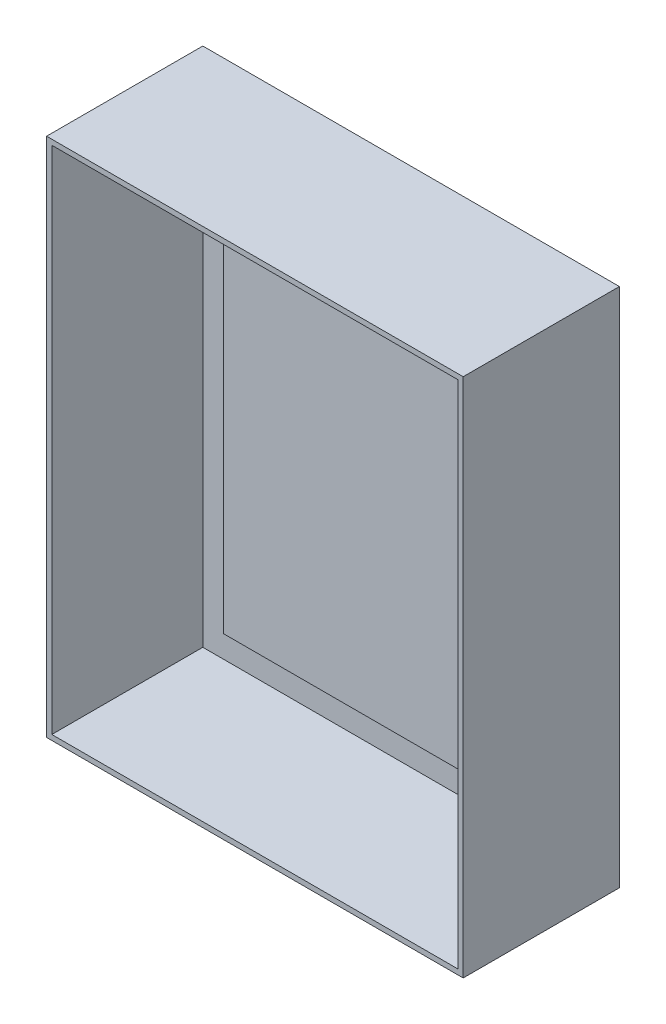
ISO-10303-21;
HEADER;
FILE_DESCRIPTION(('STEP AP214'),'2;1');
FILE_NAME('part.step','',(''),(''),'','','');
FILE_SCHEMA(('AUTOMOTIVE_DESIGN { 1 0 10303 214 1 1 1 1 }'));
ENDSEC;
DATA;
#1=APPLICATION_CONTEXT('core data for automotive mechanical design processes');
#2=APPLICATION_PROTOCOL_DEFINITION('international standard','automotive_design',2000,#1);
#3=PRODUCT_CONTEXT('',#1,'mechanical');
#4=PRODUCT('Part','Part','',(#3));
#5=PRODUCT_RELATED_PRODUCT_CATEGORY('part','',(#4));
#6=PRODUCT_DEFINITION_FORMATION('','',#4);
#7=PRODUCT_DEFINITION_CONTEXT('part definition',#1,'design');
#8=PRODUCT_DEFINITION('design','',#6,#7);
#9=PRODUCT_DEFINITION_SHAPE('','',#8);
#10=(LENGTH_UNIT() NAMED_UNIT(*) SI_UNIT(.MILLI.,.METRE.));
#11=(NAMED_UNIT(*) PLANE_ANGLE_UNIT() SI_UNIT($,.RADIAN.));
#12=(NAMED_UNIT(*) SI_UNIT($,.STERADIAN.) SOLID_ANGLE_UNIT());
#13=UNCERTAINTY_MEASURE_WITH_UNIT(LENGTH_MEASURE(1.E-05),#10,'distance_accuracy_value','');
#14=(GEOMETRIC_REPRESENTATION_CONTEXT(3) GLOBAL_UNCERTAINTY_ASSIGNED_CONTEXT((#13)) GLOBAL_UNIT_ASSIGNED_CONTEXT((#10,
#11,#12)) REPRESENTATION_CONTEXT('',''));
#15=CARTESIAN_POINT('',(0.,0.,0.));
#16=DIRECTION('',(0.,0.,1.));
#17=DIRECTION('',(1.,0.,0.));
#18=AXIS2_PLACEMENT_3D('',#15,#16,#17);
#19=CARTESIAN_POINT('',(0.,0.,5.08));
#20=DIRECTION('',(0.,0.,1.));
#21=DIRECTION('',(1.,0.,0.));
#22=AXIS2_PLACEMENT_3D('',#19,#20,#21);
#23=PLANE('',#22);
#24=DIRECTION('',(0.,1.,0.));
#25=VECTOR('',#24,1.);
#26=CARTESIAN_POINT('',(198.12,254.,5.08));
#27=LINE('',#26,#25);
#28=CARTESIAN_POINT('',(198.12,-248.92,5.08));
#29=VERTEX_POINT('',#28);
#30=CARTESIAN_POINT('',(198.12,248.92,5.08));
#31=VERTEX_POINT('',#30);
#32=EDGE_CURVE('E164',#29,#31,#27,.T.);
#33=ORIENTED_EDGE('',*,*,#32,.T.);
#34=DIRECTION('',(-1.,0.,0.));
#35=VECTOR('',#34,1.);
#36=CARTESIAN_POINT('',(-203.2,248.92,5.08));
#37=LINE('',#36,#35);
#38=CARTESIAN_POINT('',(-198.12,248.92,5.08));
#39=VERTEX_POINT('',#38);
#40=EDGE_CURVE('E167',#31,#39,#37,.T.);
#41=ORIENTED_EDGE('',*,*,#40,.T.);
#42=DIRECTION('',(0.,-1.,0.));
#43=VECTOR('',#42,1.);
#44=CARTESIAN_POINT('',(-198.12,254.,5.08));
#45=LINE('',#44,#43);
#46=CARTESIAN_POINT('',(-198.12,-248.92,5.08));
#47=VERTEX_POINT('',#46);
#48=EDGE_CURVE('E182',#39,#47,#45,.T.);
#49=ORIENTED_EDGE('',*,*,#48,.T.);
#50=DIRECTION('',(1.,0.,0.));
#51=VECTOR('',#50,1.);
#52=CARTESIAN_POINT('',(-203.2,-248.92,5.08));
#53=LINE('',#52,#51);
#54=EDGE_CURVE('E186',#47,#29,#53,.T.);
#55=ORIENTED_EDGE('',*,*,#54,.T.);
#56=EDGE_LOOP('',(#33,#41,#49,#55));
#57=FACE_BOUND('',#56,.T.);
#58=DIRECTION('',(-1.,0.,0.));
#59=VECTOR('',#58,1.);
#60=CARTESIAN_POINT('',(-175.26,224.79,5.08));
#61=LINE('',#60,#59);
#62=CARTESIAN_POINT('',(175.26,224.79,5.08));
#63=VERTEX_POINT('',#62);
#64=CARTESIAN_POINT('',(-175.26,224.79,5.08));
#65=VERTEX_POINT('',#64);
#66=EDGE_CURVE('E365',#63,#65,#61,.T.);
#67=ORIENTED_EDGE('',*,*,#66,.F.);
#68=DIRECTION('',(0.,1.,0.));
#69=VECTOR('',#68,1.);
#70=CARTESIAN_POINT('',(175.26,224.79,5.08));
#71=LINE('',#70,#69);
#72=CARTESIAN_POINT('',(175.26,-224.79,5.08));
#73=VERTEX_POINT('',#72);
#74=EDGE_CURVE('E162',#73,#63,#71,.T.);
#75=ORIENTED_EDGE('',*,*,#74,.F.);
#76=DIRECTION('',(1.,0.,0.));
#77=VECTOR('',#76,1.);
#78=CARTESIAN_POINT('',(-175.26,-224.79,5.08));
#79=LINE('',#78,#77);
#80=CARTESIAN_POINT('',(-175.26,-224.79,5.08));
#81=VERTEX_POINT('',#80);
#82=EDGE_CURVE('E158',#81,#73,#79,.T.);
#83=ORIENTED_EDGE('',*,*,#82,.F.);
#84=DIRECTION('',(0.,-1.,0.));
#85=VECTOR('',#84,1.);
#86=CARTESIAN_POINT('',(-175.26,224.79,5.08));
#87=LINE('',#86,#85);
#88=EDGE_CURVE('E362',#65,#81,#87,.T.);
#89=ORIENTED_EDGE('',*,*,#88,.F.);
#90=EDGE_LOOP('',(#67,#75,#83,#89));
#91=FACE_BOUND('',#90,.T.);
#92=ADVANCED_FACE('F49',(#57,#91),#23,.T.);
#93=CARTESIAN_POINT('',(203.2,254.,152.4));
#94=DIRECTION('',(-1.,0.,0.));
#95=DIRECTION('',(0.,-1.,0.));
#96=AXIS2_PLACEMENT_3D('',#93,#94,#95);
#97=PLANE('',#96);
#98=DIRECTION('',(0.,1.,0.));
#99=VECTOR('',#98,1.);
#100=CARTESIAN_POINT('',(203.2,254.,0.));
#101=LINE('',#100,#99);
#102=CARTESIAN_POINT('',(203.2,-254.,0.));
#103=VERTEX_POINT('',#102);
#104=CARTESIAN_POINT('',(203.2,254.,0.));
#105=VERTEX_POINT('',#104);
#106=EDGE_CURVE('E175',#103,#105,#101,.T.);
#107=ORIENTED_EDGE('',*,*,#106,.T.);
#108=DIRECTION('',(0.,0.,-1.));
#109=VECTOR('',#108,1.);
#110=CARTESIAN_POINT('',(203.2,254.,152.4));
#111=LINE('',#110,#109);
#112=CARTESIAN_POINT('',(203.2,254.,152.4));
#113=VERTEX_POINT('',#112);
#114=EDGE_CURVE('E11',#113,#105,#111,.T.);
#115=ORIENTED_EDGE('',*,*,#114,.F.);
#116=DIRECTION('',(0.,1.,0.));
#117=VECTOR('',#116,1.);
#118=CARTESIAN_POINT('',(203.2,254.,152.4));
#119=LINE('',#118,#117);
#120=CARTESIAN_POINT('',(203.2,-254.,152.4));
#121=VERTEX_POINT('',#120);
#122=EDGE_CURVE('E196',#121,#113,#119,.T.);
#123=ORIENTED_EDGE('',*,*,#122,.F.);
#124=DIRECTION('',(0.,0.,-1.));
#125=VECTOR('',#124,1.);
#126=CARTESIAN_POINT('',(203.2,-254.,152.4));
#127=LINE('',#126,#125);
#128=EDGE_CURVE('E206',#121,#103,#127,.T.);
#129=ORIENTED_EDGE('',*,*,#128,.T.);
#130=EDGE_LOOP('',(#107,#115,#123,#129));
#131=FACE_BOUND('',#130,.T.);
#132=ADVANCED_FACE('F51',(#131),#97,.F.);
#133=CARTESIAN_POINT('',(-203.2,254.,152.4));
#134=DIRECTION('',(0.,-1.,0.));
#135=DIRECTION('',(0.,0.,-1.));
#136=AXIS2_PLACEMENT_3D('',#133,#134,#135);
#137=PLANE('',#136);
#138=DIRECTION('',(-1.,0.,0.));
#139=VECTOR('',#138,1.);
#140=CARTESIAN_POINT('',(-203.2,254.,0.));
#141=LINE('',#140,#139);
#142=CARTESIAN_POINT('',(-203.2,254.,0.));
#143=VERTEX_POINT('',#142);
#144=EDGE_CURVE('E209',#105,#143,#141,.T.);
#145=ORIENTED_EDGE('',*,*,#144,.T.);
#146=DIRECTION('',(0.,0.,-1.));
#147=VECTOR('',#146,1.);
#148=CARTESIAN_POINT('',(-203.2,254.,152.4));
#149=LINE('',#148,#147);
#150=CARTESIAN_POINT('',(-203.2,254.,152.4));
#151=VERTEX_POINT('',#150);
#152=EDGE_CURVE('E57',#151,#143,#149,.T.);
#153=ORIENTED_EDGE('',*,*,#152,.F.);
#154=DIRECTION('',(-1.,0.,0.));
#155=VECTOR('',#154,1.);
#156=CARTESIAN_POINT('',(-203.2,254.,152.4));
#157=LINE('',#156,#155);
#158=EDGE_CURVE('E199',#113,#151,#157,.T.);
#159=ORIENTED_EDGE('',*,*,#158,.F.);
#160=ORIENTED_EDGE('',*,*,#114,.T.);
#161=EDGE_LOOP('',(#145,#153,#159,#160));
#162=FACE_BOUND('',#161,.T.);
#163=ADVANCED_FACE('F239',(#162),#137,.F.);
#164=CARTESIAN_POINT('',(-203.2,254.,152.4));
#165=DIRECTION('',(1.,0.,0.));
#166=DIRECTION('',(0.,1.,0.));
#167=AXIS2_PLACEMENT_3D('',#164,#165,#166);
#168=PLANE('',#167);
#169=DIRECTION('',(0.,-1.,0.));
#170=VECTOR('',#169,1.);
#171=CARTESIAN_POINT('',(-203.2,254.,0.));
#172=LINE('',#171,#170);
#173=CARTESIAN_POINT('',(-203.2,-254.,0.));
#174=VERTEX_POINT('',#173);
#175=EDGE_CURVE('E211',#143,#174,#172,.T.);
#176=ORIENTED_EDGE('',*,*,#175,.T.);
#177=DIRECTION('',(0.,0.,-1.));
#178=VECTOR('',#177,1.);
#179=CARTESIAN_POINT('',(-203.2,-254.,152.4));
#180=LINE('',#179,#178);
#181=CARTESIAN_POINT('',(-203.2,-254.,152.4));
#182=VERTEX_POINT('',#181);
#183=EDGE_CURVE('E216',#182,#174,#180,.T.);
#184=ORIENTED_EDGE('',*,*,#183,.F.);
#185=DIRECTION('',(0.,-1.,0.));
#186=VECTOR('',#185,1.);
#187=CARTESIAN_POINT('',(-203.2,254.,152.4));
#188=LINE('',#187,#186);
#189=EDGE_CURVE('E202',#151,#182,#188,.T.);
#190=ORIENTED_EDGE('',*,*,#189,.F.);
#191=ORIENTED_EDGE('',*,*,#152,.T.);
#192=EDGE_LOOP('',(#176,#184,#190,#191));
#193=FACE_BOUND('',#192,.T.);
#194=ADVANCED_FACE('F223',(#193),#168,.F.);
#195=CARTESIAN_POINT('',(-203.2,-254.,152.4));
#196=DIRECTION('',(0.,1.,0.));
#197=DIRECTION('',(0.,0.,1.));
#198=AXIS2_PLACEMENT_3D('',#195,#196,#197);
#199=PLANE('',#198);
#200=DIRECTION('',(1.,0.,0.));
#201=VECTOR('',#200,1.);
#202=CARTESIAN_POINT('',(-203.2,-254.,0.));
#203=LINE('',#202,#201);
#204=EDGE_CURVE('E200',#174,#103,#203,.T.);
#205=ORIENTED_EDGE('',*,*,#204,.T.);
#206=ORIENTED_EDGE('',*,*,#128,.F.);
#207=DIRECTION('',(1.,0.,0.));
#208=VECTOR('',#207,1.);
#209=CARTESIAN_POINT('',(-203.2,-254.,152.4));
#210=LINE('',#209,#208);
#211=EDGE_CURVE('E204',#182,#121,#210,.T.);
#212=ORIENTED_EDGE('',*,*,#211,.F.);
#213=ORIENTED_EDGE('',*,*,#183,.T.);
#214=EDGE_LOOP('',(#205,#206,#212,#213));
#215=FACE_BOUND('',#214,.T.);
#216=ADVANCED_FACE('F232',(#215),#199,.F.);
#217=CARTESIAN_POINT('',(0.,0.,152.4));
#218=DIRECTION('',(0.,0.,1.));
#219=DIRECTION('',(1.,0.,0.));
#220=AXIS2_PLACEMENT_3D('',#217,#218,#219);
#221=PLANE('',#220);
#222=DIRECTION('',(0.,1.,0.));
#223=VECTOR('',#222,1.);
#224=CARTESIAN_POINT('',(198.12,254.,152.4));
#225=LINE('',#224,#223);
#226=CARTESIAN_POINT('',(198.12,-248.92,152.4));
#227=VERTEX_POINT('',#226);
#228=CARTESIAN_POINT('',(198.12,248.92,152.4));
#229=VERTEX_POINT('',#228);
#230=EDGE_CURVE('E189',#227,#229,#225,.T.);
#231=ORIENTED_EDGE('',*,*,#230,.F.);
#232=DIRECTION('',(1.,0.,0.));
#233=VECTOR('',#232,1.);
#234=CARTESIAN_POINT('',(-203.2,-248.92,152.4));
#235=LINE('',#234,#233);
#236=CARTESIAN_POINT('',(-198.12,-248.92,152.4));
#237=VERTEX_POINT('',#236);
#238=EDGE_CURVE('E180',#237,#227,#235,.T.);
#239=ORIENTED_EDGE('',*,*,#238,.F.);
#240=DIRECTION('',(0.,-1.,0.));
#241=VECTOR('',#240,1.);
#242=CARTESIAN_POINT('',(-198.12,254.,152.4));
#243=LINE('',#242,#241);
#244=CARTESIAN_POINT('',(-198.12,248.92,152.4));
#245=VERTEX_POINT('',#244);
#246=EDGE_CURVE('E193',#245,#237,#243,.T.);
#247=ORIENTED_EDGE('',*,*,#246,.F.);
#248=DIRECTION('',(-1.,0.,0.));
#249=VECTOR('',#248,1.);
#250=CARTESIAN_POINT('',(-203.2,248.92,152.4));
#251=LINE('',#250,#249);
#252=EDGE_CURVE('E191',#229,#245,#251,.T.);
#253=ORIENTED_EDGE('',*,*,#252,.F.);
#254=EDGE_LOOP('',(#231,#239,#247,#253));
#255=FACE_BOUND('',#254,.T.);
#256=ORIENTED_EDGE('',*,*,#122,.T.);
#257=ORIENTED_EDGE('',*,*,#158,.T.);
#258=ORIENTED_EDGE('',*,*,#189,.T.);
#259=ORIENTED_EDGE('',*,*,#211,.T.);
#260=EDGE_LOOP('',(#256,#257,#258,#259));
#261=FACE_BOUND('',#260,.T.);
#262=ADVANCED_FACE('F238',(#255,#261),#221,.T.);
#263=CARTESIAN_POINT('',(0.,0.,0.));
#264=DIRECTION('',(0.,0.,1.));
#265=DIRECTION('',(1.,0.,0.));
#266=AXIS2_PLACEMENT_3D('',#263,#264,#265);
#267=PLANE('',#266);
#268=ORIENTED_EDGE('',*,*,#106,.F.);
#269=ORIENTED_EDGE('',*,*,#204,.F.);
#270=ORIENTED_EDGE('',*,*,#175,.F.);
#271=ORIENTED_EDGE('',*,*,#144,.F.);
#272=EDGE_LOOP('',(#268,#269,#270,#271));
#273=FACE_BOUND('',#272,.T.);
#274=ADVANCED_FACE('F229',(#273),#267,.F.);
#275=CARTESIAN_POINT('',(198.12,254.,152.4));
#276=DIRECTION('',(-1.,0.,0.));
#277=DIRECTION('',(0.,-1.,0.));
#278=AXIS2_PLACEMENT_3D('',#275,#276,#277);
#279=PLANE('',#278);
#280=ORIENTED_EDGE('',*,*,#32,.F.);
#281=DIRECTION('',(0.,0.,-1.));
#282=VECTOR('',#281,1.);
#283=CARTESIAN_POINT('',(198.12,-248.92,152.4));
#284=LINE('',#283,#282);
#285=EDGE_CURVE('E177',#227,#29,#284,.T.);
#286=ORIENTED_EDGE('',*,*,#285,.F.);
#287=ORIENTED_EDGE('',*,*,#230,.T.);
#288=DIRECTION('',(0.,0.,-1.));
#289=VECTOR('',#288,1.);
#290=CARTESIAN_POINT('',(198.12,248.92,152.4));
#291=LINE('',#290,#289);
#292=EDGE_CURVE('E172',#229,#31,#291,.T.);
#293=ORIENTED_EDGE('',*,*,#292,.T.);
#294=EDGE_LOOP('',(#280,#286,#287,#293));
#295=FACE_BOUND('',#294,.T.);
#296=ADVANCED_FACE('F263',(#295),#279,.T.);
#297=CARTESIAN_POINT('',(-203.2,248.92,152.4));
#298=DIRECTION('',(0.,-1.,0.));
#299=DIRECTION('',(0.,0.,-1.));
#300=AXIS2_PLACEMENT_3D('',#297,#298,#299);
#301=PLANE('',#300);
#302=ORIENTED_EDGE('',*,*,#40,.F.);
#303=ORIENTED_EDGE('',*,*,#292,.F.);
#304=ORIENTED_EDGE('',*,*,#252,.T.);
#305=DIRECTION('',(0.,0.,-1.));
#306=VECTOR('',#305,1.);
#307=CARTESIAN_POINT('',(-198.12,248.92,152.4));
#308=LINE('',#307,#306);
#309=EDGE_CURVE('E176',#245,#39,#308,.T.);
#310=ORIENTED_EDGE('',*,*,#309,.T.);
#311=EDGE_LOOP('',(#302,#303,#304,#310));
#312=FACE_BOUND('',#311,.T.);
#313=ADVANCED_FACE('F286',(#312),#301,.T.);
#314=CARTESIAN_POINT('',(-198.12,254.,152.4));
#315=DIRECTION('',(1.,0.,0.));
#316=DIRECTION('',(0.,1.,0.));
#317=AXIS2_PLACEMENT_3D('',#314,#315,#316);
#318=PLANE('',#317);
#319=ORIENTED_EDGE('',*,*,#48,.F.);
#320=ORIENTED_EDGE('',*,*,#309,.F.);
#321=ORIENTED_EDGE('',*,*,#246,.T.);
#322=DIRECTION('',(0.,0.,-1.));
#323=VECTOR('',#322,1.);
#324=CARTESIAN_POINT('',(-198.12,-248.92,152.4));
#325=LINE('',#324,#323);
#326=EDGE_CURVE('E72',#237,#47,#325,.T.);
#327=ORIENTED_EDGE('',*,*,#326,.T.);
#328=EDGE_LOOP('',(#319,#320,#321,#327));
#329=FACE_BOUND('',#328,.T.);
#330=ADVANCED_FACE('F295',(#329),#318,.T.);
#331=CARTESIAN_POINT('',(-203.2,-248.92,152.4));
#332=DIRECTION('',(0.,1.,0.));
#333=DIRECTION('',(0.,0.,1.));
#334=AXIS2_PLACEMENT_3D('',#331,#332,#333);
#335=PLANE('',#334);
#336=ORIENTED_EDGE('',*,*,#54,.F.);
#337=ORIENTED_EDGE('',*,*,#326,.F.);
#338=ORIENTED_EDGE('',*,*,#238,.T.);
#339=ORIENTED_EDGE('',*,*,#285,.T.);
#340=EDGE_LOOP('',(#336,#337,#338,#339));
#341=FACE_BOUND('',#340,.T.);
#342=ADVANCED_FACE('F256',(#341),#335,.T.);
#343=CARTESIAN_POINT('',(175.26,224.79,7.62));
#344=DIRECTION('',(-1.,0.,0.));
#345=DIRECTION('',(0.,-1.,0.));
#346=AXIS2_PLACEMENT_3D('',#343,#344,#345);
#347=PLANE('',#346);
#348=ORIENTED_EDGE('',*,*,#74,.T.);
#349=DIRECTION('',(0.,0.,-1.));
#350=VECTOR('',#349,1.);
#351=CARTESIAN_POINT('',(175.26,224.79,7.62));
#352=LINE('',#351,#350);
#353=CARTESIAN_POINT('',(175.26,224.79,7.62));
#354=VERTEX_POINT('',#353);
#355=EDGE_CURVE('E143',#354,#63,#352,.T.);
#356=ORIENTED_EDGE('',*,*,#355,.F.);
#357=DIRECTION('',(0.,1.,0.));
#358=VECTOR('',#357,1.);
#359=CARTESIAN_POINT('',(175.26,224.79,7.62));
#360=LINE('',#359,#358);
#361=CARTESIAN_POINT('',(175.26,-224.79,7.62));
#362=VERTEX_POINT('',#361);
#363=EDGE_CURVE('E150',#362,#354,#360,.T.);
#364=ORIENTED_EDGE('',*,*,#363,.F.);
#365=DIRECTION('',(0.,0.,-1.));
#366=VECTOR('',#365,1.);
#367=CARTESIAN_POINT('',(175.26,-224.79,7.62));
#368=LINE('',#367,#366);
#369=EDGE_CURVE('E360',#362,#73,#368,.T.);
#370=ORIENTED_EDGE('',*,*,#369,.T.);
#371=EDGE_LOOP('',(#348,#356,#364,#370));
#372=FACE_BOUND('',#371,.T.);
#373=ADVANCED_FACE('F160',(#372),#347,.F.);
#374=CARTESIAN_POINT('',(-175.26,224.79,7.62));
#375=DIRECTION('',(0.,-1.,0.));
#376=DIRECTION('',(0.,0.,-1.));
#377=AXIS2_PLACEMENT_3D('',#374,#375,#376);
#378=PLANE('',#377);
#379=ORIENTED_EDGE('',*,*,#66,.T.);
#380=DIRECTION('',(0.,0.,-1.));
#381=VECTOR('',#380,1.);
#382=CARTESIAN_POINT('',(-175.26,224.79,7.62));
#383=LINE('',#382,#381);
#384=CARTESIAN_POINT('',(-175.26,224.79,7.62));
#385=VERTEX_POINT('',#384);
#386=EDGE_CURVE('E146',#385,#65,#383,.T.);
#387=ORIENTED_EDGE('',*,*,#386,.F.);
#388=DIRECTION('',(-1.,0.,0.));
#389=VECTOR('',#388,1.);
#390=CARTESIAN_POINT('',(-175.26,224.79,7.62));
#391=LINE('',#390,#389);
#392=EDGE_CURVE('E139',#354,#385,#391,.T.);
#393=ORIENTED_EDGE('',*,*,#392,.F.);
#394=ORIENTED_EDGE('',*,*,#355,.T.);
#395=EDGE_LOOP('',(#379,#387,#393,#394));
#396=FACE_BOUND('',#395,.T.);
#397=ADVANCED_FACE('F141',(#396),#378,.F.);
#398=CARTESIAN_POINT('',(-175.26,224.79,7.62));
#399=DIRECTION('',(1.,0.,0.));
#400=DIRECTION('',(0.,1.,0.));
#401=AXIS2_PLACEMENT_3D('',#398,#399,#400);
#402=PLANE('',#401);
#403=ORIENTED_EDGE('',*,*,#88,.T.);
#404=DIRECTION('',(0.,0.,-1.));
#405=VECTOR('',#404,1.);
#406=CARTESIAN_POINT('',(-175.26,-224.79,7.62));
#407=LINE('',#406,#405);
#408=CARTESIAN_POINT('',(-175.26,-224.79,7.62));
#409=VERTEX_POINT('',#408);
#410=EDGE_CURVE('E64',#409,#81,#407,.T.);
#411=ORIENTED_EDGE('',*,*,#410,.F.);
#412=DIRECTION('',(0.,-1.,0.));
#413=VECTOR('',#412,1.);
#414=CARTESIAN_POINT('',(-175.26,224.79,7.62));
#415=LINE('',#414,#413);
#416=EDGE_CURVE('E149',#385,#409,#415,.T.);
#417=ORIENTED_EDGE('',*,*,#416,.F.);
#418=ORIENTED_EDGE('',*,*,#386,.T.);
#419=EDGE_LOOP('',(#403,#411,#417,#418));
#420=FACE_BOUND('',#419,.T.);
#421=ADVANCED_FACE('F330',(#420),#402,.F.);
#422=CARTESIAN_POINT('',(-175.26,-224.79,7.62));
#423=DIRECTION('',(0.,1.,0.));
#424=DIRECTION('',(0.,0.,1.));
#425=AXIS2_PLACEMENT_3D('',#422,#423,#424);
#426=PLANE('',#425);
#427=ORIENTED_EDGE('',*,*,#82,.T.);
#428=ORIENTED_EDGE('',*,*,#369,.F.);
#429=DIRECTION('',(1.,0.,0.));
#430=VECTOR('',#429,1.);
#431=CARTESIAN_POINT('',(-175.26,-224.79,7.62));
#432=LINE('',#431,#430);
#433=EDGE_CURVE('E154',#409,#362,#432,.T.);
#434=ORIENTED_EDGE('',*,*,#433,.F.);
#435=ORIENTED_EDGE('',*,*,#410,.T.);
#436=EDGE_LOOP('',(#427,#428,#434,#435));
#437=FACE_BOUND('',#436,.T.);
#438=ADVANCED_FACE('F339',(#437),#426,.F.);
#439=CARTESIAN_POINT('',(0.,0.,7.62));
#440=DIRECTION('',(0.,0.,1.));
#441=DIRECTION('',(1.,0.,0.));
#442=AXIS2_PLACEMENT_3D('',#439,#440,#441);
#443=PLANE('',#442);
#444=ORIENTED_EDGE('',*,*,#363,.T.);
#445=ORIENTED_EDGE('',*,*,#392,.T.);
#446=ORIENTED_EDGE('',*,*,#416,.T.);
#447=ORIENTED_EDGE('',*,*,#433,.T.);
#448=EDGE_LOOP('',(#444,#445,#446,#447));
#449=FACE_BOUND('',#448,.T.);
#450=ADVANCED_FACE('F153',(#449),#443,.T.);
#451=CLOSED_SHELL('',(#92,#132,#163,#194,#216,#262,#274,#296,#313,#330,#342,#373,#397,#421,#438,#450));
#452=MANIFOLD_SOLID_BREP('B2',#451);
#453=ADVANCED_BREP_SHAPE_REPRESENTATION('',(#18,#452),#14);
#454=SHAPE_DEFINITION_REPRESENTATION(#9,#453);
ENDSEC;
END-ISO-10303-21;
